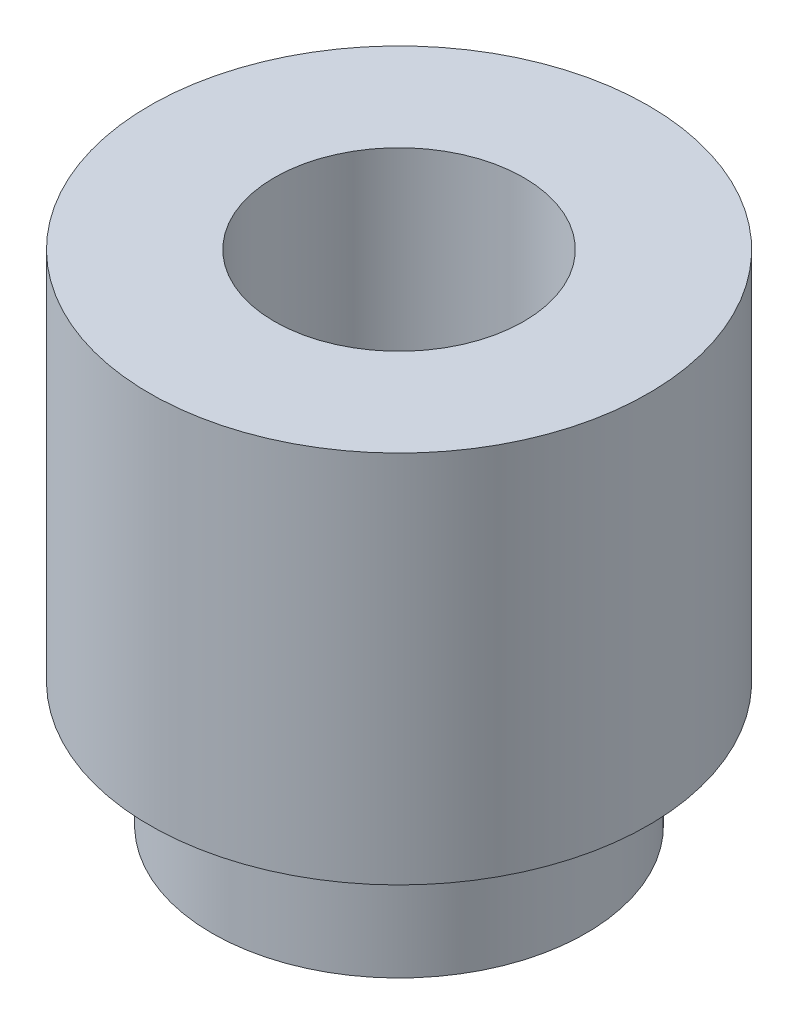
ISO-10303-21;
HEADER;
FILE_DESCRIPTION(('STEP AP214'),'2;1');
FILE_NAME('part.step','',(''),(''),'','','');
FILE_SCHEMA(('AUTOMOTIVE_DESIGN { 1 0 10303 214 1 1 1 1 }'));
ENDSEC;
DATA;
#1=APPLICATION_CONTEXT('core data for automotive mechanical design processes');
#2=APPLICATION_PROTOCOL_DEFINITION('international standard','automotive_design',2000,#1);
#3=PRODUCT_CONTEXT('',#1,'mechanical');
#4=PRODUCT('Part','Part','',(#3));
#5=PRODUCT_RELATED_PRODUCT_CATEGORY('part','',(#4));
#6=PRODUCT_DEFINITION_FORMATION('','',#4);
#7=PRODUCT_DEFINITION_CONTEXT('part definition',#1,'design');
#8=PRODUCT_DEFINITION('design','',#6,#7);
#9=PRODUCT_DEFINITION_SHAPE('','',#8);
#10=(LENGTH_UNIT() NAMED_UNIT(*) SI_UNIT(.MILLI.,.METRE.));
#11=(NAMED_UNIT(*) PLANE_ANGLE_UNIT() SI_UNIT($,.RADIAN.));
#12=(NAMED_UNIT(*) SI_UNIT($,.STERADIAN.) SOLID_ANGLE_UNIT());
#13=UNCERTAINTY_MEASURE_WITH_UNIT(LENGTH_MEASURE(1.E-05),#10,'distance_accuracy_value','');
#14=(GEOMETRIC_REPRESENTATION_CONTEXT(3) GLOBAL_UNCERTAINTY_ASSIGNED_CONTEXT((#13)) GLOBAL_UNIT_ASSIGNED_CONTEXT((#10,
#11,#12)) REPRESENTATION_CONTEXT('',''));
#15=CARTESIAN_POINT('',(0.,0.,0.));
#16=DIRECTION('',(0.,0.,1.));
#17=DIRECTION('',(1.,0.,0.));
#18=AXIS2_PLACEMENT_3D('',#15,#16,#17);
#19=CARTESIAN_POINT('',(0.,4.,-2.));
#20=DIRECTION('',(0.,1.,0.));
#21=DIRECTION('',(0.,0.,1.));
#22=AXIS2_PLACEMENT_3D('',#19,#20,#21);
#23=PLANE('',#22);
#24=CARTESIAN_POINT('',(0.,4.,0.));
#25=DIRECTION('',(0.,-1.,0.));
#26=DIRECTION('',(0.,0.,-1.));
#27=AXIS2_PLACEMENT_3D('',#24,#25,#26);
#28=CIRCLE('',#27,1.);
#29=CARTESIAN_POINT('',(0.,4.,-1.));
#30=VERTEX_POINT('',#29);
#31=EDGE_CURVE('E10',#30,#30,#28,.T.);
#32=ORIENTED_EDGE('',*,*,#31,.T.);
#33=EDGE_LOOP('',(#32));
#34=FACE_BOUND('',#33,.T.);
#35=CARTESIAN_POINT('',(0.,4.,0.));
#36=DIRECTION('',(0.,-1.,0.));
#37=DIRECTION('',(0.,0.,-1.));
#38=AXIS2_PLACEMENT_3D('',#35,#36,#37);
#39=CIRCLE('',#38,2.);
#40=CARTESIAN_POINT('',(0.,4.,-2.));
#41=VERTEX_POINT('',#40);
#42=EDGE_CURVE('E57',#41,#41,#39,.T.);
#43=ORIENTED_EDGE('',*,*,#42,.F.);
#44=EDGE_LOOP('',(#43));
#45=FACE_BOUND('',#44,.T.);
#46=ADVANCED_FACE('F35',(#34,#45),#23,.T.);
#47=CARTESIAN_POINT('',(0.,0.,0.));
#48=DIRECTION('',(0.,-1.,0.));
#49=DIRECTION('',(0.,0.,-1.));
#50=AXIS2_PLACEMENT_3D('',#47,#48,#49);
#51=CYLINDRICAL_SURFACE('',#50,1.);
#52=CARTESIAN_POINT('',(0.,0.,0.));
#53=DIRECTION('',(0.,-1.,0.));
#54=DIRECTION('',(0.,0.,-1.));
#55=AXIS2_PLACEMENT_3D('',#52,#53,#54);
#56=CIRCLE('',#55,1.);
#57=CARTESIAN_POINT('',(0.,0.,-1.));
#58=VERTEX_POINT('',#57);
#59=EDGE_CURVE('E41',#58,#58,#56,.T.);
#60=ORIENTED_EDGE('',*,*,#59,.T.);
#61=EDGE_LOOP('',(#60));
#62=FACE_BOUND('',#61,.T.);
#63=ORIENTED_EDGE('',*,*,#31,.F.);
#64=EDGE_LOOP('',(#63));
#65=FACE_BOUND('',#64,.T.);
#66=ADVANCED_FACE('F65',(#62,#65),#51,.F.);
#67=CARTESIAN_POINT('',(0.,0.,-1.));
#68=DIRECTION('',(0.,-1.,0.));
#69=DIRECTION('',(0.,0.,-1.));
#70=AXIS2_PLACEMENT_3D('',#67,#68,#69);
#71=PLANE('',#70);
#72=CARTESIAN_POINT('',(0.,0.,0.));
#73=DIRECTION('',(0.,-1.,0.));
#74=DIRECTION('',(0.,0.,-1.));
#75=AXIS2_PLACEMENT_3D('',#72,#73,#74);
#76=CIRCLE('',#75,1.5);
#77=CARTESIAN_POINT('',(0.,0.,-1.5));
#78=VERTEX_POINT('',#77);
#79=EDGE_CURVE('E45',#78,#78,#76,.T.);
#80=ORIENTED_EDGE('',*,*,#79,.T.);
#81=EDGE_LOOP('',(#80));
#82=FACE_BOUND('',#81,.T.);
#83=ORIENTED_EDGE('',*,*,#59,.F.);
#84=EDGE_LOOP('',(#83));
#85=FACE_BOUND('',#84,.T.);
#86=ADVANCED_FACE('F69',(#82,#85),#71,.T.);
#87=CARTESIAN_POINT('',(0.,0.,0.));
#88=DIRECTION('',(0.,-1.,0.));
#89=DIRECTION('',(0.,0.,-1.));
#90=AXIS2_PLACEMENT_3D('',#87,#88,#89);
#91=CYLINDRICAL_SURFACE('',#90,1.5);
#92=CARTESIAN_POINT('',(0.,1.,0.));
#93=DIRECTION('',(0.,-1.,0.));
#94=DIRECTION('',(0.,0.,-1.));
#95=AXIS2_PLACEMENT_3D('',#92,#93,#94);
#96=CIRCLE('',#95,1.5);
#97=CARTESIAN_POINT('',(0.,1.,-1.5));
#98=VERTEX_POINT('',#97);
#99=EDGE_CURVE('E49',#98,#98,#96,.T.);
#100=ORIENTED_EDGE('',*,*,#99,.T.);
#101=EDGE_LOOP('',(#100));
#102=FACE_BOUND('',#101,.T.);
#103=ORIENTED_EDGE('',*,*,#79,.F.);
#104=EDGE_LOOP('',(#103));
#105=FACE_BOUND('',#104,.T.);
#106=ADVANCED_FACE('F73',(#102,#105),#91,.T.);
#107=CARTESIAN_POINT('',(0.,1.,-1.5));
#108=DIRECTION('',(0.,-1.,0.));
#109=DIRECTION('',(0.,0.,-1.));
#110=AXIS2_PLACEMENT_3D('',#107,#108,#109);
#111=PLANE('',#110);
#112=CARTESIAN_POINT('',(0.,1.,0.));
#113=DIRECTION('',(0.,-1.,0.));
#114=DIRECTION('',(0.,0.,-1.));
#115=AXIS2_PLACEMENT_3D('',#112,#113,#114);
#116=CIRCLE('',#115,2.);
#117=CARTESIAN_POINT('',(0.,1.,-2.));
#118=VERTEX_POINT('',#117);
#119=EDGE_CURVE('E54',#118,#118,#116,.T.);
#120=ORIENTED_EDGE('',*,*,#119,.T.);
#121=EDGE_LOOP('',(#120));
#122=FACE_BOUND('',#121,.T.);
#123=ORIENTED_EDGE('',*,*,#99,.F.);
#124=EDGE_LOOP('',(#123));
#125=FACE_BOUND('',#124,.T.);
#126=ADVANCED_FACE('F80',(#122,#125),#111,.T.);
#127=CARTESIAN_POINT('',(0.,0.,0.));
#128=DIRECTION('',(0.,-1.,0.));
#129=DIRECTION('',(0.,0.,-1.));
#130=AXIS2_PLACEMENT_3D('',#127,#128,#129);
#131=CYLINDRICAL_SURFACE('',#130,2.);
#132=ORIENTED_EDGE('',*,*,#42,.T.);
#133=EDGE_LOOP('',(#132));
#134=FACE_BOUND('',#133,.T.);
#135=ORIENTED_EDGE('',*,*,#119,.F.);
#136=EDGE_LOOP('',(#135));
#137=FACE_BOUND('',#136,.T.);
#138=ADVANCED_FACE('F61',(#134,#137),#131,.T.);
#139=CLOSED_SHELL('',(#46,#66,#86,#106,#126,#138));
#140=MANIFOLD_SOLID_BREP('B2',#139);
#141=ADVANCED_BREP_SHAPE_REPRESENTATION('',(#18,#140),#14);
#142=SHAPE_DEFINITION_REPRESENTATION(#9,#141);
ENDSEC;
END-ISO-10303-21;
